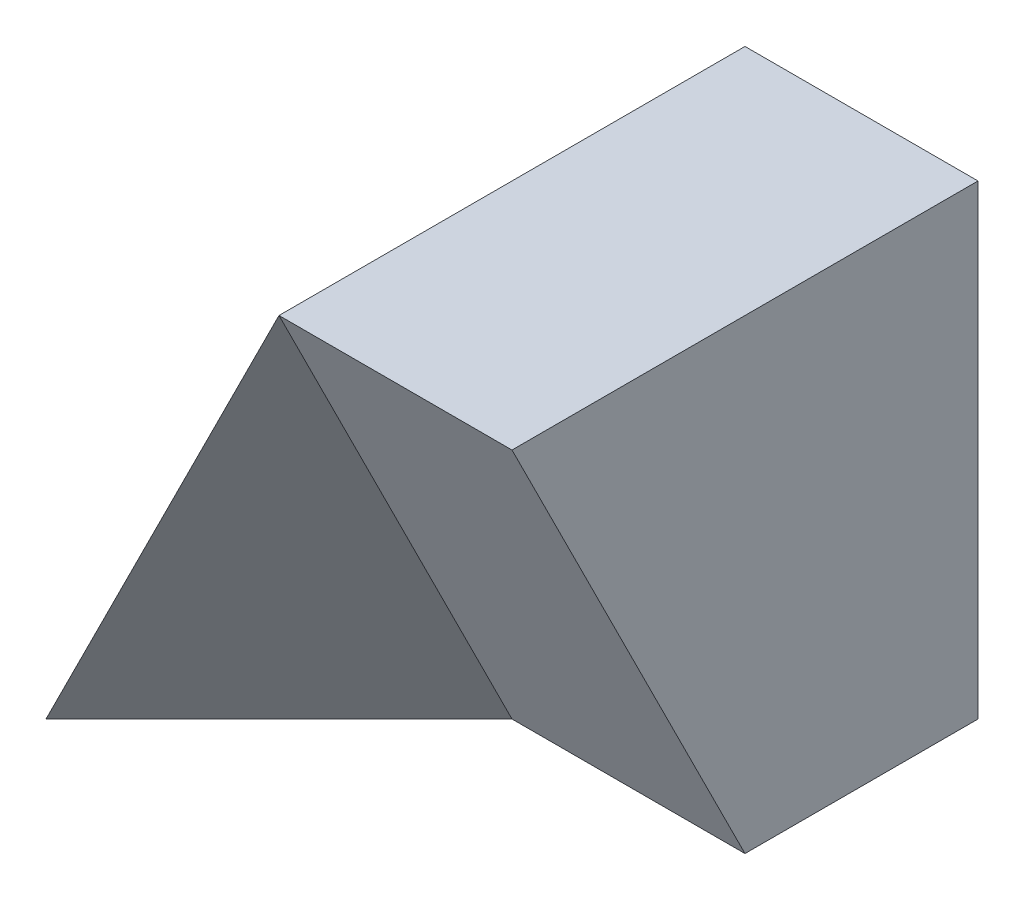
ISO-10303-21;
HEADER;
FILE_DESCRIPTION(('STEP AP214'),'2;1');
FILE_NAME('part.step','',(''),(''),'','','');
FILE_SCHEMA(('AUTOMOTIVE_DESIGN { 1 0 10303 214 1 1 1 1 }'));
ENDSEC;
DATA;
#1=APPLICATION_CONTEXT('core data for automotive mechanical design processes');
#2=APPLICATION_PROTOCOL_DEFINITION('international standard','automotive_design',2000,#1);
#3=PRODUCT_CONTEXT('',#1,'mechanical');
#4=PRODUCT('Part','Part','',(#3));
#5=PRODUCT_RELATED_PRODUCT_CATEGORY('part','',(#4));
#6=PRODUCT_DEFINITION_FORMATION('','',#4);
#7=PRODUCT_DEFINITION_CONTEXT('part definition',#1,'design');
#8=PRODUCT_DEFINITION('design','',#6,#7);
#9=PRODUCT_DEFINITION_SHAPE('','',#8);
#10=(LENGTH_UNIT() NAMED_UNIT(*) SI_UNIT(.MILLI.,.METRE.));
#11=(NAMED_UNIT(*) PLANE_ANGLE_UNIT() SI_UNIT($,.RADIAN.));
#12=(NAMED_UNIT(*) SI_UNIT($,.STERADIAN.) SOLID_ANGLE_UNIT());
#13=UNCERTAINTY_MEASURE_WITH_UNIT(LENGTH_MEASURE(1.E-05),#10,'distance_accuracy_value','');
#14=(GEOMETRIC_REPRESENTATION_CONTEXT(3) GLOBAL_UNCERTAINTY_ASSIGNED_CONTEXT((#13)) GLOBAL_UNIT_ASSIGNED_CONTEXT((#10,
#11,#12)) REPRESENTATION_CONTEXT('',''));
#15=CARTESIAN_POINT('',(0.,0.,0.));
#16=DIRECTION('',(0.,0.,1.));
#17=DIRECTION('',(1.,0.,0.));
#18=AXIS2_PLACEMENT_3D('',#15,#16,#17);
#19=CARTESIAN_POINT('',(0.,0.,40.));
#20=DIRECTION('',(0.,1.,0.));
#21=DIRECTION('',(0.,0.,1.));
#22=AXIS2_PLACEMENT_3D('',#19,#20,#21);
#23=PLANE('',#22);
#24=DIRECTION('',(0.707106781186547,0.,-0.707106781186548));
#25=VECTOR('',#24,1.);
#26=CARTESIAN_POINT('',(20.,0.,20.));
#27=LINE('',#26,#25);
#28=CARTESIAN_POINT('',(0.,0.,40.));
#29=VERTEX_POINT('',#28);
#30=CARTESIAN_POINT('',(20.,0.,20.));
#31=VERTEX_POINT('',#30);
#32=EDGE_CURVE('E79',#29,#31,#27,.T.);
#33=ORIENTED_EDGE('',*,*,#32,.F.);
#34=DIRECTION('',(0.,0.,-1.));
#35=VECTOR('',#34,1.);
#36=CARTESIAN_POINT('',(0.,0.,40.));
#37=LINE('',#36,#35);
#38=CARTESIAN_POINT('',(0.,0.,0.));
#39=VERTEX_POINT('',#38);
#40=EDGE_CURVE('E11',#29,#39,#37,.T.);
#41=ORIENTED_EDGE('',*,*,#40,.T.);
#42=DIRECTION('',(1.,0.,0.));
#43=VECTOR('',#42,1.);
#44=CARTESIAN_POINT('',(0.,0.,0.));
#45=LINE('',#44,#43);
#46=CARTESIAN_POINT('',(40.,0.,0.));
#47=VERTEX_POINT('',#46);
#48=EDGE_CURVE('E99',#39,#47,#45,.T.);
#49=ORIENTED_EDGE('',*,*,#48,.T.);
#50=DIRECTION('',(0.,0.,-1.));
#51=VECTOR('',#50,1.);
#52=CARTESIAN_POINT('',(40.,0.,40.));
#53=LINE('',#52,#51);
#54=CARTESIAN_POINT('',(40.,0.,20.));
#55=VERTEX_POINT('',#54);
#56=EDGE_CURVE('E40',#55,#47,#53,.T.);
#57=ORIENTED_EDGE('',*,*,#56,.F.);
#58=DIRECTION('',(1.,0.,0.));
#59=VECTOR('',#58,1.);
#60=CARTESIAN_POINT('',(20.,0.,20.));
#61=LINE('',#60,#59);
#62=EDGE_CURVE('E85',#31,#55,#61,.T.);
#63=ORIENTED_EDGE('',*,*,#62,.F.);
#64=EDGE_LOOP('',(#33,#41,#49,#57,#63));
#65=FACE_BOUND('',#64,.T.);
#66=ADVANCED_FACE('F33',(#65),#23,.F.);
#67=CARTESIAN_POINT('',(40.,0.,40.));
#68=DIRECTION('',(-1.,0.,0.));
#69=DIRECTION('',(0.,0.,1.));
#70=AXIS2_PLACEMENT_3D('',#67,#68,#69);
#71=PLANE('',#70);
#72=DIRECTION('',(0.,0.,-1.));
#73=VECTOR('',#72,1.);
#74=CARTESIAN_POINT('',(40.,40.,40.));
#75=LINE('',#74,#73);
#76=CARTESIAN_POINT('',(40.,40.,40.));
#77=VERTEX_POINT('',#76);
#78=CARTESIAN_POINT('',(40.,40.,0.));
#79=VERTEX_POINT('',#78);
#80=EDGE_CURVE('E109',#77,#79,#75,.T.);
#81=ORIENTED_EDGE('',*,*,#80,.F.);
#82=DIRECTION('',(0.,0.894427190999916,0.447213595499958));
#83=VECTOR('',#82,1.);
#84=CARTESIAN_POINT('',(40.,0.,20.));
#85=LINE('',#84,#83);
#86=EDGE_CURVE('E91',#55,#77,#85,.T.);
#87=ORIENTED_EDGE('',*,*,#86,.F.);
#88=ORIENTED_EDGE('',*,*,#56,.T.);
#89=DIRECTION('',(0.,1.,0.));
#90=VECTOR('',#89,1.);
#91=CARTESIAN_POINT('',(40.,0.,0.));
#92=LINE('',#91,#90);
#93=EDGE_CURVE('E55',#47,#79,#92,.T.);
#94=ORIENTED_EDGE('',*,*,#93,.T.);
#95=EDGE_LOOP('',(#81,#87,#88,#94));
#96=FACE_BOUND('',#95,.T.);
#97=ADVANCED_FACE('F111',(#96),#71,.F.);
#98=CARTESIAN_POINT('',(0.,40.,40.));
#99=DIRECTION('',(0.,-1.,0.));
#100=DIRECTION('',(0.,0.,-1.));
#101=AXIS2_PLACEMENT_3D('',#98,#99,#100);
#102=PLANE('',#101);
#103=DIRECTION('',(-1.,0.,0.));
#104=VECTOR('',#103,1.);
#105=CARTESIAN_POINT('',(0.,40.,0.));
#106=LINE('',#105,#104);
#107=CARTESIAN_POINT('',(20.,40.,0.));
#108=VERTEX_POINT('',#107);
#109=EDGE_CURVE('E102',#79,#108,#106,.T.);
#110=ORIENTED_EDGE('',*,*,#109,.T.);
#111=DIRECTION('',(0.,0.,1.));
#112=VECTOR('',#111,1.);
#113=CARTESIAN_POINT('',(20.,40.,0.));
#114=LINE('',#113,#112);
#115=CARTESIAN_POINT('',(20.,40.,40.));
#116=VERTEX_POINT('',#115);
#117=EDGE_CURVE('E47',#108,#116,#114,.T.);
#118=ORIENTED_EDGE('',*,*,#117,.T.);
#119=DIRECTION('',(-1.,0.,0.));
#120=VECTOR('',#119,1.);
#121=CARTESIAN_POINT('',(0.,40.,40.));
#122=LINE('',#121,#120);
#123=EDGE_CURVE('E106',#77,#116,#122,.T.);
#124=ORIENTED_EDGE('',*,*,#123,.F.);
#125=ORIENTED_EDGE('',*,*,#80,.T.);
#126=EDGE_LOOP('',(#110,#118,#124,#125));
#127=FACE_BOUND('',#126,.T.);
#128=ADVANCED_FACE('F119',(#127),#102,.F.);
#129=CARTESIAN_POINT('',(0.,0.,0.));
#130=DIRECTION('',(0.,0.,-1.));
#131=DIRECTION('',(-1.,0.,0.));
#132=AXIS2_PLACEMENT_3D('',#129,#130,#131);
#133=PLANE('',#132);
#134=DIRECTION('',(0.447213595499958,0.894427190999916,0.));
#135=VECTOR('',#134,1.);
#136=CARTESIAN_POINT('',(0.,0.,0.));
#137=LINE('',#136,#135);
#138=EDGE_CURVE('E84',#39,#108,#137,.T.);
#139=ORIENTED_EDGE('',*,*,#138,.T.);
#140=ORIENTED_EDGE('',*,*,#109,.F.);
#141=ORIENTED_EDGE('',*,*,#93,.F.);
#142=ORIENTED_EDGE('',*,*,#48,.F.);
#143=EDGE_LOOP('',(#139,#140,#141,#142));
#144=FACE_BOUND('',#143,.T.);
#145=ADVANCED_FACE('F100',(#144),#133,.T.);
#146=CARTESIAN_POINT('',(0.,0.,0.));
#147=DIRECTION('',(0.894427190999916,-0.447213595499958,0.));
#148=DIRECTION('',(0.447213595499958,0.894427190999916,0.));
#149=AXIS2_PLACEMENT_3D('',#146,#147,#148);
#150=PLANE('',#149);
#151=DIRECTION('',(0.447213595499958,0.894427190999916,0.));
#152=VECTOR('',#151,1.);
#153=CARTESIAN_POINT('',(0.,0.,40.));
#154=LINE('',#153,#152);
#155=EDGE_CURVE('E76',#29,#116,#154,.T.);
#156=ORIENTED_EDGE('',*,*,#155,.T.);
#157=ORIENTED_EDGE('',*,*,#117,.F.);
#158=ORIENTED_EDGE('',*,*,#138,.F.);
#159=ORIENTED_EDGE('',*,*,#40,.F.);
#160=EDGE_LOOP('',(#156,#157,#158,#159));
#161=FACE_BOUND('',#160,.T.);
#162=ADVANCED_FACE('F93',(#161),#150,.F.);
#163=CARTESIAN_POINT('',(20.,0.,20.));
#164=DIRECTION('',(0.,0.447213595499958,-0.894427190999916));
#165=DIRECTION('',(0.,0.894427190999916,0.447213595499958));
#166=AXIS2_PLACEMENT_3D('',#163,#164,#165);
#167=PLANE('',#166);
#168=ORIENTED_EDGE('',*,*,#86,.T.);
#169=ORIENTED_EDGE('',*,*,#123,.T.);
#170=DIRECTION('',(0.,0.894427190999916,0.447213595499958));
#171=VECTOR('',#170,1.);
#172=CARTESIAN_POINT('',(20.,0.,20.));
#173=LINE('',#172,#171);
#174=EDGE_CURVE('E81',#31,#116,#173,.T.);
#175=ORIENTED_EDGE('',*,*,#174,.F.);
#176=ORIENTED_EDGE('',*,*,#62,.T.);
#177=EDGE_LOOP('',(#168,#169,#175,#176));
#178=FACE_BOUND('',#177,.T.);
#179=ADVANCED_FACE('F117',(#178),#167,.F.);
#180=CARTESIAN_POINT('',(17.7777777777778,-8.8888888888889,17.7777777777778));
#181=DIRECTION('',(0.666666666666667,-0.333333333333333,0.666666666666667));
#182=DIRECTION('',(0.707106781186547,0.,-0.707106781186548));
#183=AXIS2_PLACEMENT_3D('',#180,#181,#182);
#184=PLANE('',#183);
#185=ORIENTED_EDGE('',*,*,#155,.F.);
#186=ORIENTED_EDGE('',*,*,#32,.T.);
#187=ORIENTED_EDGE('',*,*,#174,.T.);
#188=EDGE_LOOP('',(#185,#186,#187));
#189=FACE_BOUND('',#188,.T.);
#190=ADVANCED_FACE('F78',(#189),#184,.T.);
#191=CLOSED_SHELL('',(#66,#97,#128,#145,#162,#179,#190));
#192=MANIFOLD_SOLID_BREP('B2',#191);
#193=ADVANCED_BREP_SHAPE_REPRESENTATION('',(#18,#192),#14);
#194=SHAPE_DEFINITION_REPRESENTATION(#9,#193);
ENDSEC;
END-ISO-10303-21;
